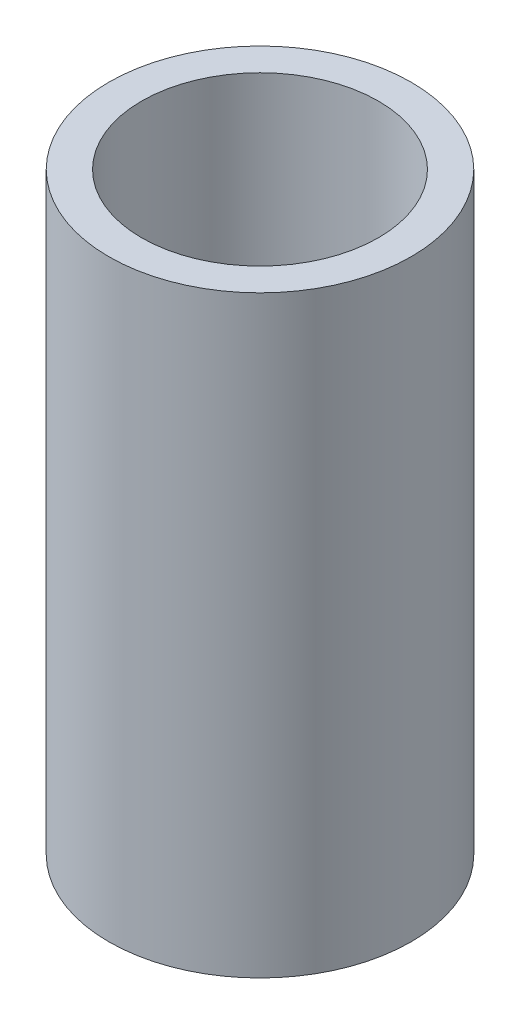
ISO-10303-21;
HEADER;
FILE_DESCRIPTION(('STEP AP214'),'2;1');
FILE_NAME('part.step','',(''),(''),'','','');
FILE_SCHEMA(('AUTOMOTIVE_DESIGN { 1 0 10303 214 1 1 1 1 }'));
ENDSEC;
DATA;
#1=APPLICATION_CONTEXT('core data for automotive mechanical design processes');
#2=APPLICATION_PROTOCOL_DEFINITION('international standard','automotive_design',2000,#1);
#3=PRODUCT_CONTEXT('',#1,'mechanical');
#4=PRODUCT('Part','Part','',(#3));
#5=PRODUCT_RELATED_PRODUCT_CATEGORY('part','',(#4));
#6=PRODUCT_DEFINITION_FORMATION('','',#4);
#7=PRODUCT_DEFINITION_CONTEXT('part definition',#1,'design');
#8=PRODUCT_DEFINITION('design','',#6,#7);
#9=PRODUCT_DEFINITION_SHAPE('','',#8);
#10=(LENGTH_UNIT() NAMED_UNIT(*) SI_UNIT(.MILLI.,.METRE.));
#11=(NAMED_UNIT(*) PLANE_ANGLE_UNIT() SI_UNIT($,.RADIAN.));
#12=(NAMED_UNIT(*) SI_UNIT($,.STERADIAN.) SOLID_ANGLE_UNIT());
#13=UNCERTAINTY_MEASURE_WITH_UNIT(LENGTH_MEASURE(1.E-05),#10,'distance_accuracy_value','');
#14=(GEOMETRIC_REPRESENTATION_CONTEXT(3) GLOBAL_UNCERTAINTY_ASSIGNED_CONTEXT((#13)) GLOBAL_UNIT_ASSIGNED_CONTEXT((#10,
#11,#12)) REPRESENTATION_CONTEXT('',''));
#15=CARTESIAN_POINT('',(0.,0.,0.));
#16=DIRECTION('',(0.,0.,1.));
#17=DIRECTION('',(1.,0.,0.));
#18=AXIS2_PLACEMENT_3D('',#15,#16,#17);
#19=CARTESIAN_POINT('',(0.,68.6914206470985,0.));
#20=DIRECTION('',(0.,-1.,0.));
#21=DIRECTION('',(0.,0.,-1.));
#22=AXIS2_PLACEMENT_3D('',#19,#20,#21);
#23=CYLINDRICAL_SURFACE('',#22,17.5);
#24=CARTESIAN_POINT('',(0.,68.6914206470985,0.));
#25=DIRECTION('',(0.,1.,0.));
#26=DIRECTION('',(0.,0.,1.));
#27=AXIS2_PLACEMENT_3D('',#24,#25,#26);
#28=CIRCLE('',#27,17.5);
#29=CARTESIAN_POINT('',(0.,68.6914206470985,17.5));
#30=VERTEX_POINT('',#29);
#31=EDGE_CURVE('E10',#30,#30,#28,.T.);
#32=ORIENTED_EDGE('',*,*,#31,.F.);
#33=EDGE_LOOP('',(#32));
#34=FACE_BOUND('',#33,.T.);
#35=CARTESIAN_POINT('',(0.,0.,0.));
#36=DIRECTION('',(0.,1.,0.));
#37=DIRECTION('',(0.,0.,1.));
#38=AXIS2_PLACEMENT_3D('',#35,#36,#37);
#39=CIRCLE('',#38,17.5);
#40=CARTESIAN_POINT('',(0.,0.,17.5));
#41=VERTEX_POINT('',#40);
#42=EDGE_CURVE('E37',#41,#41,#39,.T.);
#43=ORIENTED_EDGE('',*,*,#42,.T.);
#44=EDGE_LOOP('',(#43));
#45=FACE_BOUND('',#44,.T.);
#46=ADVANCED_FACE('F40',(#34,#45),#23,.T.);
#47=CARTESIAN_POINT('',(0.,68.6914206470985,0.));
#48=DIRECTION('',(0.,1.,0.));
#49=DIRECTION('',(0.,0.,1.));
#50=AXIS2_PLACEMENT_3D('',#47,#48,#49);
#51=PLANE('',#50);
#52=CARTESIAN_POINT('',(0.,68.6914206470985,0.));
#53=DIRECTION('',(0.,1.,0.));
#54=DIRECTION('',(0.,0.,1.));
#55=AXIS2_PLACEMENT_3D('',#52,#53,#54);
#56=CIRCLE('',#55,13.7103238430395);
#57=CARTESIAN_POINT('',(0.,68.6914206470985,13.7103238430395));
#58=VERTEX_POINT('',#57);
#59=EDGE_CURVE('E50',#58,#58,#56,.T.);
#60=ORIENTED_EDGE('',*,*,#59,.F.);
#61=EDGE_LOOP('',(#60));
#62=FACE_BOUND('',#61,.T.);
#63=ORIENTED_EDGE('',*,*,#31,.T.);
#64=EDGE_LOOP('',(#63));
#65=FACE_BOUND('',#64,.T.);
#66=ADVANCED_FACE('F59',(#62,#65),#51,.T.);
#67=CARTESIAN_POINT('',(0.,0.,0.));
#68=DIRECTION('',(0.,1.,0.));
#69=DIRECTION('',(0.,0.,1.));
#70=AXIS2_PLACEMENT_3D('',#67,#68,#69);
#71=PLANE('',#70);
#72=CARTESIAN_POINT('',(0.,0.,0.));
#73=DIRECTION('',(0.,1.,0.));
#74=DIRECTION('',(0.,0.,1.));
#75=AXIS2_PLACEMENT_3D('',#72,#73,#74);
#76=CIRCLE('',#75,13.7103238430395);
#77=CARTESIAN_POINT('',(0.,0.,13.7103238430395));
#78=VERTEX_POINT('',#77);
#79=EDGE_CURVE('E47',#78,#78,#76,.T.);
#80=ORIENTED_EDGE('',*,*,#79,.T.);
#81=EDGE_LOOP('',(#80));
#82=FACE_BOUND('',#81,.T.);
#83=ORIENTED_EDGE('',*,*,#42,.F.);
#84=EDGE_LOOP('',(#83));
#85=FACE_BOUND('',#84,.T.);
#86=ADVANCED_FACE('F58',(#82,#85),#71,.F.);
#87=CARTESIAN_POINT('',(0.,68.6914206470985,0.));
#88=DIRECTION('',(0.,-1.,0.));
#89=DIRECTION('',(0.,0.,-1.));
#90=AXIS2_PLACEMENT_3D('',#87,#88,#89);
#91=CYLINDRICAL_SURFACE('',#90,13.7103238430395);
#92=ORIENTED_EDGE('',*,*,#59,.T.);
#93=EDGE_LOOP('',(#92));
#94=FACE_BOUND('',#93,.T.);
#95=ORIENTED_EDGE('',*,*,#79,.F.);
#96=EDGE_LOOP('',(#95));
#97=FACE_BOUND('',#96,.T.);
#98=ADVANCED_FACE('F54',(#94,#97),#91,.F.);
#99=CLOSED_SHELL('',(#46,#66,#86,#98));
#100=MANIFOLD_SOLID_BREP('B2',#99);
#101=ADVANCED_BREP_SHAPE_REPRESENTATION('',(#18,#100),#14);
#102=SHAPE_DEFINITION_REPRESENTATION(#9,#101);
ENDSEC;
END-ISO-10303-21;
